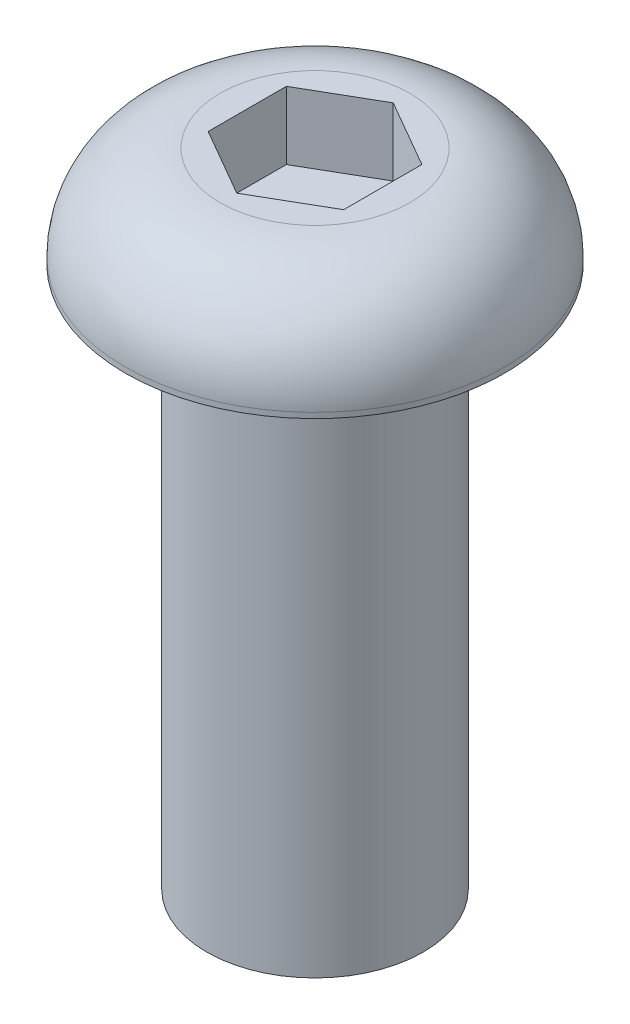
ISO-10303-21;
HEADER;
FILE_DESCRIPTION(('STEP AP214'),'2;1');
FILE_NAME('part.step','',(''),(''),'','','');
FILE_SCHEMA(('AUTOMOTIVE_DESIGN { 1 0 10303 214 1 1 1 1 }'));
ENDSEC;
DATA;
#1=APPLICATION_CONTEXT('core data for automotive mechanical design processes');
#2=APPLICATION_PROTOCOL_DEFINITION('international standard','automotive_design',2000,#1);
#3=PRODUCT_CONTEXT('',#1,'mechanical');
#4=PRODUCT('Part','Part','',(#3));
#5=PRODUCT_RELATED_PRODUCT_CATEGORY('part','',(#4));
#6=PRODUCT_DEFINITION_FORMATION('','',#4);
#7=PRODUCT_DEFINITION_CONTEXT('part definition',#1,'design');
#8=PRODUCT_DEFINITION('design','',#6,#7);
#9=PRODUCT_DEFINITION_SHAPE('','',#8);
#10=(LENGTH_UNIT() NAMED_UNIT(*) SI_UNIT(.MILLI.,.METRE.));
#11=(NAMED_UNIT(*) PLANE_ANGLE_UNIT() SI_UNIT($,.RADIAN.));
#12=(NAMED_UNIT(*) SI_UNIT($,.STERADIAN.) SOLID_ANGLE_UNIT());
#13=UNCERTAINTY_MEASURE_WITH_UNIT(LENGTH_MEASURE(1.E-05),#10,'distance_accuracy_value','');
#14=(GEOMETRIC_REPRESENTATION_CONTEXT(3) GLOBAL_UNCERTAINTY_ASSIGNED_CONTEXT((#13)) GLOBAL_UNIT_ASSIGNED_CONTEXT((#10,
#11,#12)) REPRESENTATION_CONTEXT('',''));
#15=CARTESIAN_POINT('',(0.,0.,0.));
#16=DIRECTION('',(0.,0.,1.));
#17=DIRECTION('',(1.,0.,0.));
#18=AXIS2_PLACEMENT_3D('',#15,#16,#17);
#19=CARTESIAN_POINT('',(0.,0.,0.));
#20=DIRECTION('',(0.,1.,0.));
#21=DIRECTION('',(0.,0.,1.));
#22=AXIS2_PLACEMENT_3D('',#19,#20,#21);
#23=PLANE('',#22);
#24=CARTESIAN_POINT('',(0.,0.,0.));
#25=DIRECTION('',(0.,1.,0.));
#26=DIRECTION('',(0.,0.,1.));
#27=AXIS2_PLACEMENT_3D('',#24,#25,#26);
#28=CIRCLE('',#27,8.);
#29=CARTESIAN_POINT('',(0.,0.,8.));
#30=VERTEX_POINT('',#29);
#31=EDGE_CURVE('E11',#30,#30,#28,.T.);
#32=ORIENTED_EDGE('',*,*,#31,.F.);
#33=EDGE_LOOP('',(#32));
#34=FACE_BOUND('',#33,.T.);
#35=ADVANCED_FACE('F33',(#34),#23,.F.);
#36=CARTESIAN_POINT('',(0.,47.4,0.));
#37=DIRECTION('',(0.,1.,0.));
#38=DIRECTION('',(0.,0.,1.));
#39=AXIS2_PLACEMENT_3D('',#36,#37,#38);
#40=CYLINDRICAL_SURFACE('',#39,8.);
#41=CARTESIAN_POINT('',(0.,40.,0.));
#42=DIRECTION('',(0.,1.,0.));
#43=DIRECTION('',(0.,0.,1.));
#44=AXIS2_PLACEMENT_3D('',#41,#42,#43);
#45=CIRCLE('',#44,8.);
#46=CARTESIAN_POINT('',(0.,40.,8.));
#47=VERTEX_POINT('',#46);
#48=EDGE_CURVE('E40',#47,#47,#45,.T.);
#49=ORIENTED_EDGE('',*,*,#48,.F.);
#50=EDGE_LOOP('',(#49));
#51=FACE_BOUND('',#50,.T.);
#52=ORIENTED_EDGE('',*,*,#31,.T.);
#53=EDGE_LOOP('',(#52));
#54=FACE_BOUND('',#53,.T.);
#55=ADVANCED_FACE('F152',(#51,#54),#40,.T.);
#56=CARTESIAN_POINT('',(8.,40.,0.));
#57=DIRECTION('',(0.,1.,0.));
#58=DIRECTION('',(0.,0.,1.));
#59=AXIS2_PLACEMENT_3D('',#56,#57,#58);
#60=PLANE('',#59);
#61=CARTESIAN_POINT('',(0.,40.,0.));
#62=DIRECTION('',(0.,1.,0.));
#63=DIRECTION('',(0.,0.,1.));
#64=AXIS2_PLACEMENT_3D('',#61,#62,#63);
#65=CIRCLE('',#64,14.);
#66=CARTESIAN_POINT('',(0.,40.,14.));
#67=VERTEX_POINT('',#66);
#68=EDGE_CURVE('E145',#67,#67,#65,.T.);
#69=ORIENTED_EDGE('',*,*,#68,.F.);
#70=EDGE_LOOP('',(#69));
#71=FACE_BOUND('',#70,.T.);
#72=ORIENTED_EDGE('',*,*,#48,.T.);
#73=EDGE_LOOP('',(#72));
#74=FACE_BOUND('',#73,.T.);
#75=ADVANCED_FACE('F150',(#71,#74),#60,.F.);
#76=CARTESIAN_POINT('',(0.,47.4,0.));
#77=DIRECTION('',(0.,1.,0.));
#78=DIRECTION('',(0.,0.,1.));
#79=AXIS2_PLACEMENT_3D('',#76,#77,#78);
#80=CYLINDRICAL_SURFACE('',#79,14.);
#81=CARTESIAN_POINT('',(0.,40.4,0.));
#82=DIRECTION('',(0.,1.,0.));
#83=DIRECTION('',(0.,0.,1.));
#84=AXIS2_PLACEMENT_3D('',#81,#82,#83);
#85=CIRCLE('',#84,14.);
#86=CARTESIAN_POINT('',(0.,40.4,14.));
#87=VERTEX_POINT('',#86);
#88=EDGE_CURVE('E142',#87,#87,#85,.T.);
#89=ORIENTED_EDGE('',*,*,#88,.F.);
#90=EDGE_LOOP('',(#89));
#91=FACE_BOUND('',#90,.T.);
#92=ORIENTED_EDGE('',*,*,#68,.T.);
#93=EDGE_LOOP('',(#92));
#94=FACE_BOUND('',#93,.T.);
#95=ADVANCED_FACE('F170',(#91,#94),#80,.T.);
#96=CARTESIAN_POINT('',(0.,40.4,0.));
#97=DIRECTION('',(0.,1.,0.));
#98=DIRECTION('',(0.,0.,1.));
#99=AXIS2_PLACEMENT_3D('',#96,#97,#98);
#100=TOROIDAL_SURFACE('',#99,7.,7.);
#101=CARTESIAN_POINT('',(0.,47.4,0.));
#102=DIRECTION('',(0.,1.,0.));
#103=DIRECTION('',(0.,0.,1.));
#104=AXIS2_PLACEMENT_3D('',#101,#102,#103);
#105=CIRCLE('',#104,7.);
#106=CARTESIAN_POINT('',(0.,47.4,7.));
#107=VERTEX_POINT('',#106);
#108=EDGE_CURVE('E134',#107,#107,#105,.T.);
#109=ORIENTED_EDGE('',*,*,#108,.F.);
#110=EDGE_LOOP('',(#109));
#111=FACE_BOUND('',#110,.T.);
#112=ORIENTED_EDGE('',*,*,#88,.T.);
#113=EDGE_LOOP('',(#112));
#114=FACE_BOUND('',#113,.T.);
#115=ADVANCED_FACE('F178',(#111,#114),#100,.T.);
#116=CARTESIAN_POINT('',(7.,47.4,0.));
#117=DIRECTION('',(0.,-1.,0.));
#118=DIRECTION('',(0.,0.,-1.));
#119=AXIS2_PLACEMENT_3D('',#116,#117,#118);
#120=PLANE('',#119);
#121=DIRECTION('',(-0.866025403784438,0.,0.5));
#122=VECTOR('',#121,1.);
#123=CARTESIAN_POINT('',(0.,47.4,-5.77350269189626));
#124=LINE('',#123,#122);
#125=CARTESIAN_POINT('',(0.,47.4,-5.77350269189626));
#126=VERTEX_POINT('',#125);
#127=CARTESIAN_POINT('',(-5.,47.4,-2.88675134594813));
#128=VERTEX_POINT('',#127);
#129=EDGE_CURVE('E121',#126,#128,#124,.T.);
#130=ORIENTED_EDGE('',*,*,#129,.F.);
#131=DIRECTION('',(-0.866025403784439,0.,-0.5));
#132=VECTOR('',#131,1.);
#133=CARTESIAN_POINT('',(5.,47.4,-2.88675134594813));
#134=LINE('',#133,#132);
#135=CARTESIAN_POINT('',(5.,47.4,-2.88675134594813));
#136=VERTEX_POINT('',#135);
#137=EDGE_CURVE('E47',#136,#126,#134,.T.);
#138=ORIENTED_EDGE('',*,*,#137,.F.);
#139=DIRECTION('',(0.,0.,-1.));
#140=VECTOR('',#139,1.);
#141=CARTESIAN_POINT('',(5.,47.4,2.88675134594813));
#142=LINE('',#141,#140);
#143=CARTESIAN_POINT('',(5.,47.4,2.88675134594813));
#144=VERTEX_POINT('',#143);
#145=EDGE_CURVE('E130',#144,#136,#142,.T.);
#146=ORIENTED_EDGE('',*,*,#145,.F.);
#147=DIRECTION('',(0.866025403784438,0.,-0.5));
#148=VECTOR('',#147,1.);
#149=CARTESIAN_POINT('',(0.,47.4,5.77350269189626));
#150=LINE('',#149,#148);
#151=CARTESIAN_POINT('',(0.,47.4,5.77350269189626));
#152=VERTEX_POINT('',#151);
#153=EDGE_CURVE('E128',#152,#144,#150,.T.);
#154=ORIENTED_EDGE('',*,*,#153,.F.);
#155=DIRECTION('',(0.866025403784439,0.,0.5));
#156=VECTOR('',#155,1.);
#157=CARTESIAN_POINT('',(-5.,47.4,2.88675134594813));
#158=LINE('',#157,#156);
#159=CARTESIAN_POINT('',(-5.,47.4,2.88675134594813));
#160=VERTEX_POINT('',#159);
#161=EDGE_CURVE('E95',#160,#152,#158,.T.);
#162=ORIENTED_EDGE('',*,*,#161,.F.);
#163=DIRECTION('',(0.,0.,1.));
#164=VECTOR('',#163,1.);
#165=CARTESIAN_POINT('',(-5.,47.4,-2.88675134594813));
#166=LINE('',#165,#164);
#167=EDGE_CURVE('E124',#128,#160,#166,.T.);
#168=ORIENTED_EDGE('',*,*,#167,.F.);
#169=EDGE_LOOP('',(#130,#138,#146,#154,#162,#168));
#170=FACE_BOUND('',#169,.T.);
#171=ORIENTED_EDGE('',*,*,#108,.T.);
#172=EDGE_LOOP('',(#171));
#173=FACE_BOUND('',#172,.T.);
#174=ADVANCED_FACE('F186',(#170,#173),#120,.F.);
#175=CARTESIAN_POINT('',(5.,42.4,-2.88675134594813));
#176=DIRECTION('',(0.5,0.,-0.866025403784438));
#177=DIRECTION('',(-0.866025403784439,0.,-0.5));
#178=AXIS2_PLACEMENT_3D('',#175,#176,#177);
#179=PLANE('',#178);
#180=ORIENTED_EDGE('',*,*,#137,.T.);
#181=DIRECTION('',(0.,1.,0.));
#182=VECTOR('',#181,1.);
#183=CARTESIAN_POINT('',(0.,42.4,-5.77350269189626));
#184=LINE('',#183,#182);
#185=CARTESIAN_POINT('',(0.,42.4,-5.77350269189626));
#186=VERTEX_POINT('',#185);
#187=EDGE_CURVE('E77',#186,#126,#184,.T.);
#188=ORIENTED_EDGE('',*,*,#187,.F.);
#189=DIRECTION('',(-0.866025403784439,0.,-0.5));
#190=VECTOR('',#189,1.);
#191=CARTESIAN_POINT('',(5.,42.4,-2.88675134594813));
#192=LINE('',#191,#190);
#193=CARTESIAN_POINT('',(5.,42.4,-2.88675134594813));
#194=VERTEX_POINT('',#193);
#195=EDGE_CURVE('E132',#194,#186,#192,.T.);
#196=ORIENTED_EDGE('',*,*,#195,.F.);
#197=DIRECTION('',(0.,1.,0.));
#198=VECTOR('',#197,1.);
#199=CARTESIAN_POINT('',(5.,42.4,-2.88675134594813));
#200=LINE('',#199,#198);
#201=EDGE_CURVE('E55',#194,#136,#200,.T.);
#202=ORIENTED_EDGE('',*,*,#201,.T.);
#203=EDGE_LOOP('',(#180,#188,#196,#202));
#204=FACE_BOUND('',#203,.T.);
#205=ADVANCED_FACE('F194',(#204),#179,.F.);
#206=CARTESIAN_POINT('',(5.,42.4,2.88675134594813));
#207=DIRECTION('',(1.,0.,0.));
#208=DIRECTION('',(0.,0.,-1.));
#209=AXIS2_PLACEMENT_3D('',#206,#207,#208);
#210=PLANE('',#209);
#211=ORIENTED_EDGE('',*,*,#145,.T.);
#212=ORIENTED_EDGE('',*,*,#201,.F.);
#213=DIRECTION('',(0.,0.,-1.));
#214=VECTOR('',#213,1.);
#215=CARTESIAN_POINT('',(5.,42.4,2.88675134594813));
#216=LINE('',#215,#214);
#217=CARTESIAN_POINT('',(5.,42.4,2.88675134594813));
#218=VERTEX_POINT('',#217);
#219=EDGE_CURVE('E107',#218,#194,#216,.T.);
#220=ORIENTED_EDGE('',*,*,#219,.F.);
#221=DIRECTION('',(0.,1.,0.));
#222=VECTOR('',#221,1.);
#223=CARTESIAN_POINT('',(5.,42.4,2.88675134594813));
#224=LINE('',#223,#222);
#225=EDGE_CURVE('E99',#218,#144,#224,.T.);
#226=ORIENTED_EDGE('',*,*,#225,.T.);
#227=EDGE_LOOP('',(#211,#212,#220,#226));
#228=FACE_BOUND('',#227,.T.);
#229=ADVANCED_FACE('F202',(#228),#210,.F.);
#230=CARTESIAN_POINT('',(0.,42.4,5.77350269189626));
#231=DIRECTION('',(0.5,0.,0.866025403784439));
#232=DIRECTION('',(0.866025403784439,0.,-0.5));
#233=AXIS2_PLACEMENT_3D('',#230,#231,#232);
#234=PLANE('',#233);
#235=ORIENTED_EDGE('',*,*,#153,.T.);
#236=ORIENTED_EDGE('',*,*,#225,.F.);
#237=DIRECTION('',(0.866025403784438,0.,-0.5));
#238=VECTOR('',#237,1.);
#239=CARTESIAN_POINT('',(0.,42.4,5.77350269189626));
#240=LINE('',#239,#238);
#241=CARTESIAN_POINT('',(0.,42.4,5.77350269189626));
#242=VERTEX_POINT('',#241);
#243=EDGE_CURVE('E103',#242,#218,#240,.T.);
#244=ORIENTED_EDGE('',*,*,#243,.F.);
#245=DIRECTION('',(0.,1.,0.));
#246=VECTOR('',#245,1.);
#247=CARTESIAN_POINT('',(0.,42.4,5.77350269189626));
#248=LINE('',#247,#246);
#249=EDGE_CURVE('E88',#242,#152,#248,.T.);
#250=ORIENTED_EDGE('',*,*,#249,.T.);
#251=EDGE_LOOP('',(#235,#236,#244,#250));
#252=FACE_BOUND('',#251,.T.);
#253=ADVANCED_FACE('F104',(#252),#234,.F.);
#254=CARTESIAN_POINT('',(-5.,42.4,2.88675134594813));
#255=DIRECTION('',(-0.5,0.,0.866025403784438));
#256=DIRECTION('',(0.866025403784439,0.,0.5));
#257=AXIS2_PLACEMENT_3D('',#254,#255,#256);
#258=PLANE('',#257);
#259=ORIENTED_EDGE('',*,*,#161,.T.);
#260=ORIENTED_EDGE('',*,*,#249,.F.);
#261=DIRECTION('',(0.866025403784439,0.,0.5));
#262=VECTOR('',#261,1.);
#263=CARTESIAN_POINT('',(-5.,42.4,2.88675134594813));
#264=LINE('',#263,#262);
#265=CARTESIAN_POINT('',(-5.,42.4,2.88675134594813));
#266=VERTEX_POINT('',#265);
#267=EDGE_CURVE('E92',#266,#242,#264,.T.);
#268=ORIENTED_EDGE('',*,*,#267,.F.);
#269=DIRECTION('',(0.,1.,0.));
#270=VECTOR('',#269,1.);
#271=CARTESIAN_POINT('',(-5.,42.4,2.88675134594813));
#272=LINE('',#271,#270);
#273=EDGE_CURVE('E100',#266,#160,#272,.T.);
#274=ORIENTED_EDGE('',*,*,#273,.T.);
#275=EDGE_LOOP('',(#259,#260,#268,#274));
#276=FACE_BOUND('',#275,.T.);
#277=ADVANCED_FACE('F90',(#276),#258,.F.);
#278=CARTESIAN_POINT('',(-5.,42.4,-2.88675134594813));
#279=DIRECTION('',(-1.,0.,0.));
#280=DIRECTION('',(0.,0.,1.));
#281=AXIS2_PLACEMENT_3D('',#278,#279,#280);
#282=PLANE('',#281);
#283=ORIENTED_EDGE('',*,*,#167,.T.);
#284=ORIENTED_EDGE('',*,*,#273,.F.);
#285=DIRECTION('',(0.,0.,1.));
#286=VECTOR('',#285,1.);
#287=CARTESIAN_POINT('',(-5.,42.4,-2.88675134594813));
#288=LINE('',#287,#286);
#289=CARTESIAN_POINT('',(-5.,42.4,-2.88675134594813));
#290=VERTEX_POINT('',#289);
#291=EDGE_CURVE('E113',#290,#266,#288,.T.);
#292=ORIENTED_EDGE('',*,*,#291,.F.);
#293=DIRECTION('',(0.,1.,0.));
#294=VECTOR('',#293,1.);
#295=CARTESIAN_POINT('',(-5.,42.4,-2.88675134594813));
#296=LINE('',#295,#294);
#297=EDGE_CURVE('E137',#290,#128,#296,.T.);
#298=ORIENTED_EDGE('',*,*,#297,.T.);
#299=EDGE_LOOP('',(#283,#284,#292,#298));
#300=FACE_BOUND('',#299,.T.);
#301=ADVANCED_FACE('F221',(#300),#282,.F.);
#302=CARTESIAN_POINT('',(0.,42.4,-5.77350269189626));
#303=DIRECTION('',(-0.5,0.,-0.866025403784438));
#304=DIRECTION('',(-0.866025403784438,0.,0.5));
#305=AXIS2_PLACEMENT_3D('',#302,#303,#304);
#306=PLANE('',#305);
#307=ORIENTED_EDGE('',*,*,#129,.T.);
#308=ORIENTED_EDGE('',*,*,#297,.F.);
#309=DIRECTION('',(-0.866025403784438,0.,0.5));
#310=VECTOR('',#309,1.);
#311=CARTESIAN_POINT('',(0.,42.4,-5.77350269189626));
#312=LINE('',#311,#310);
#313=EDGE_CURVE('E115',#186,#290,#312,.T.);
#314=ORIENTED_EDGE('',*,*,#313,.F.);
#315=ORIENTED_EDGE('',*,*,#187,.T.);
#316=EDGE_LOOP('',(#307,#308,#314,#315));
#317=FACE_BOUND('',#316,.T.);
#318=ADVANCED_FACE('F228',(#317),#306,.F.);
#319=CARTESIAN_POINT('',(0.,42.4,0.));
#320=DIRECTION('',(0.,1.,0.));
#321=DIRECTION('',(0.,0.,1.));
#322=AXIS2_PLACEMENT_3D('',#319,#320,#321);
#323=PLANE('',#322);
#324=ORIENTED_EDGE('',*,*,#195,.T.);
#325=ORIENTED_EDGE('',*,*,#313,.T.);
#326=ORIENTED_EDGE('',*,*,#291,.T.);
#327=ORIENTED_EDGE('',*,*,#267,.T.);
#328=ORIENTED_EDGE('',*,*,#243,.T.);
#329=ORIENTED_EDGE('',*,*,#219,.T.);
#330=EDGE_LOOP('',(#324,#325,#326,#327,#328,#329));
#331=FACE_BOUND('',#330,.T.);
#332=ADVANCED_FACE('F110',(#331),#323,.T.);
#333=CLOSED_SHELL('',(#35,#55,#75,#95,#115,#174,#205,#229,#253,#277,#301,#318,#332));
#334=MANIFOLD_SOLID_BREP('B2',#333);
#335=ADVANCED_BREP_SHAPE_REPRESENTATION('',(#18,#334),#14);
#336=SHAPE_DEFINITION_REPRESENTATION(#9,#335);
ENDSEC;
END-ISO-10303-21;
